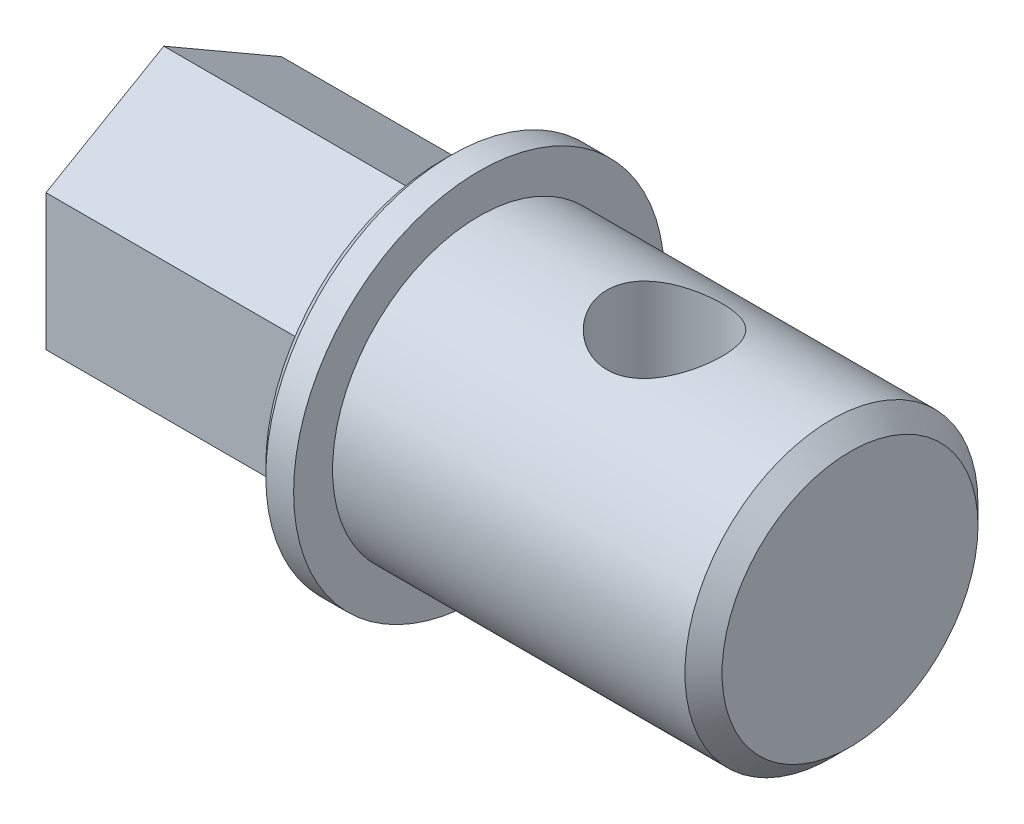
ISO-10303-21;
HEADER;
FILE_DESCRIPTION(('STEP AP214'),'2;1');
FILE_NAME('part.step','',(''),(''),'','','');
FILE_SCHEMA(('AUTOMOTIVE_DESIGN { 1 0 10303 214 1 1 1 1 }'));
ENDSEC;
DATA;
#1=APPLICATION_CONTEXT('core data for automotive mechanical design processes');
#2=APPLICATION_PROTOCOL_DEFINITION('international standard','automotive_design',2000,#1);
#3=PRODUCT_CONTEXT('',#1,'mechanical');
#4=PRODUCT('Part','Part','',(#3));
#5=PRODUCT_RELATED_PRODUCT_CATEGORY('part','',(#4));
#6=PRODUCT_DEFINITION_FORMATION('','',#4);
#7=PRODUCT_DEFINITION_CONTEXT('part definition',#1,'design');
#8=PRODUCT_DEFINITION('design','',#6,#7);
#9=PRODUCT_DEFINITION_SHAPE('','',#8);
#10=(LENGTH_UNIT() NAMED_UNIT(*) SI_UNIT(.MILLI.,.METRE.));
#11=(NAMED_UNIT(*) PLANE_ANGLE_UNIT() SI_UNIT($,.RADIAN.));
#12=(NAMED_UNIT(*) SI_UNIT($,.STERADIAN.) SOLID_ANGLE_UNIT());
#13=UNCERTAINTY_MEASURE_WITH_UNIT(LENGTH_MEASURE(1.E-05),#10,'distance_accuracy_value','');
#14=(GEOMETRIC_REPRESENTATION_CONTEXT(3) GLOBAL_UNCERTAINTY_ASSIGNED_CONTEXT((#13)) GLOBAL_UNIT_ASSIGNED_CONTEXT((#10,
#11,#12)) REPRESENTATION_CONTEXT('',''));
#15=CARTESIAN_POINT('',(0.,0.,0.));
#16=DIRECTION('',(0.,0.,1.));
#17=DIRECTION('',(1.,0.,0.));
#18=AXIS2_PLACEMENT_3D('',#15,#16,#17);
#19=CARTESIAN_POINT('',(20.,0.,0.));
#20=DIRECTION('',(-1.,0.,0.));
#21=DIRECTION('',(0.,0.,1.));
#22=AXIS2_PLACEMENT_3D('',#19,#20,#21);
#23=CYLINDRICAL_SURFACE('',#22,7.9);
#24=CARTESIAN_POINT('',(19.,0.,0.));
#25=DIRECTION('',(1.,0.,0.));
#26=DIRECTION('',(0.,0.,-1.));
#27=AXIS2_PLACEMENT_3D('',#24,#25,#26);
#28=CIRCLE('',#27,7.9);
#29=CARTESIAN_POINT('',(19.,0.,-7.9));
#30=VERTEX_POINT('',#29);
#31=EDGE_CURVE('E11',#30,#30,#28,.F.);
#32=ORIENTED_EDGE('',*,*,#31,.T.);
#33=EDGE_LOOP('',(#32));
#34=FACE_BOUND('',#33,.T.);
#35=CARTESIAN_POINT('',(10.,-7.26636084983398,3.1));
#36=CARTESIAN_POINT('',(10.1663346158653,-7.26636710949805,3.09999351847051));
#37=CARTESIAN_POINT('',(10.332955051347,-7.27215151188825,3.08653260810271));
#38=CARTESIAN_POINT('',(10.6614156667575,-7.29454929489087,3.03320818850061));
#39=CARTESIAN_POINT('',(10.8232421978606,-7.3111909710545,2.993275686265));
#40=CARTESIAN_POINT('',(11.136837463668,-7.35311644879813,2.88873826778125));
#41=CARTESIAN_POINT('',(11.288640815679,-7.37836842341094,2.82422411303483));
#42=CARTESIAN_POINT('',(11.5792296993829,-7.43462186683479,2.67262213711969));
#43=CARTESIAN_POINT('',(11.7180184258771,-7.46562191902808,2.58553987577835));
#44=CARTESIAN_POINT('',(11.9863577176001,-7.53178988522266,2.38614625265946));
#45=CARTESIAN_POINT('',(12.1151025114832,-7.56708854791225,2.27279336643924));
#46=CARTESIAN_POINT('',(12.3523408001219,-7.63679417086448,2.02627051594454));
#47=CARTESIAN_POINT('',(12.4608273547092,-7.67120082207378,1.8930937882975));
#48=CARTESIAN_POINT('',(12.6584190684678,-7.73680588764178,1.60452776876883));
#49=CARTESIAN_POINT('',(12.746638915474,-7.76783435643637,1.44849015051636));
#50=CARTESIAN_POINT('',(12.8952363077978,-7.82160938152175,1.12235484500192));
#51=CARTESIAN_POINT('',(12.9556247803773,-7.84435918747372,0.952262706866207));
#52=CARTESIAN_POINT('',(13.0439900088521,-7.8780889029301,0.611288894812916));
#53=CARTESIAN_POINT('',(13.0733510058438,-7.88956968563781,0.440816487760335));
#54=CARTESIAN_POINT('',(13.1032782997886,-7.90127416736964,0.097003592354353));
#55=CARTESIAN_POINT('',(13.1038549176573,-7.9015019012822,-0.0763358456964609));
#56=CARTESIAN_POINT('',(13.0769707233346,-7.89098374274002,-0.410982263764641));
#57=CARTESIAN_POINT('',(13.0510248395394,-7.88083077517019,-0.572432918358044));
#58=CARTESIAN_POINT('',(12.9744000798044,-7.85148454908576,-0.888475888709472));
#59=CARTESIAN_POINT('',(12.9237193950644,-7.83229062943026,-1.04306770199381));
#60=CARTESIAN_POINT('',(12.7984356728259,-7.78638595408502,-1.34376022091283));
#61=CARTESIAN_POINT('',(12.7234864867021,-7.75956716218171,-1.48969952838417));
#62=CARTESIAN_POINT('',(12.5521117557785,-7.70109054775387,-1.76730265121787));
#63=CARTESIAN_POINT('',(12.4556789739854,-7.66943109572801,-1.89896163381683));
#64=CARTESIAN_POINT('',(12.2369345031472,-7.60213011382686,-2.15313469104066));
#65=CARTESIAN_POINT('',(12.1133687799584,-7.56636337963099,-2.27453800786141));
#66=CARTESIAN_POINT('',(11.8474682063288,-7.4964461076441,-2.49534358123239));
#67=CARTESIAN_POINT('',(11.7051276940868,-7.4622960616265,-2.59473917672858));
#68=CARTESIAN_POINT('',(11.400934093372,-7.39864628524178,-2.77111583740955));
#69=CARTESIAN_POINT('',(11.2386662882743,-7.36929247480008,-2.84743866932457));
#70=CARTESIAN_POINT('',(10.9021231218695,-7.32026092803281,-2.97123993980027));
#71=CARTESIAN_POINT('',(10.7278552863409,-7.30057718904606,-3.01873627662334));
#72=CARTESIAN_POINT('',(10.3833103877494,-7.27455842500944,-3.08088870825382));
#73=CARTESIAN_POINT('',(10.2134097779068,-7.26750084415873,-3.09732569005301));
#74=CARTESIAN_POINT('',(9.87316855726062,-7.26547874677008,-3.10206978071329));
#75=CARTESIAN_POINT('',(9.70282808611748,-7.27051077392634,-3.09038492934167));
#76=CARTESIAN_POINT('',(9.37619241535563,-7.29136168311245,-3.0408365957478));
#77=CARTESIAN_POINT('',(9.2196352061247,-7.30658412661714,-3.00441907668649));
#78=CARTESIAN_POINT('',(8.91494687702002,-7.34537082896778,-2.9082973888063));
#79=CARTESIAN_POINT('',(8.7668175894863,-7.36893689384266,-2.84858817807036));
#80=CARTESIAN_POINT('',(8.47664372940254,-7.4229011344714,-2.70492734752464));
#81=CARTESIAN_POINT('',(8.33507352803402,-7.45353322003857,-2.62010812950565));
#82=CARTESIAN_POINT('',(8.06754885592117,-7.51781026296112,-2.42953287787291));
#83=CARTESIAN_POINT('',(7.94160058520701,-7.55145640747006,-2.32376857454229));
#84=CARTESIAN_POINT('',(7.69966093866379,-7.62083862099281,-2.08548659754756));
#85=CARTESIAN_POINT('',(7.58499967027525,-7.65655459372233,-1.95160756790945));
#86=CARTESIAN_POINT('',(7.37957891402032,-7.72380524707335,-1.66564707700384));
#87=CARTESIAN_POINT('',(7.28882009598321,-7.75533981050502,-1.51356510580068));
#88=CARTESIAN_POINT('',(7.1342062589481,-7.81073339597279,-1.19519200109596));
#89=CARTESIAN_POINT('',(7.07031544480831,-7.83460262013608,-1.02892012997483));
#90=CARTESIAN_POINT('',(6.97181459682315,-7.87196334688755,-0.686826238081698));
#91=CARTESIAN_POINT('',(6.93718933787567,-7.88546024523873,-0.511009233796531));
#92=CARTESIAN_POINT('',(6.89996032354475,-7.89999893201713,-0.166782109029406));
#93=CARTESIAN_POINT('',(6.8954732868068,-7.90177312742045,0.00139503627097473));
#94=CARTESIAN_POINT('',(6.91371471932851,-7.89462371314277,0.33601696631201));
#95=CARTESIAN_POINT('',(6.93643933294025,-7.88570161903031,0.502461993108063));
#96=CARTESIAN_POINT('',(7.00711865150312,-7.85851915942147,0.824011500662934));
#97=CARTESIAN_POINT('',(7.05433061774672,-7.84053412055966,0.979304350402065));
#98=CARTESIAN_POINT('',(7.17187728788584,-7.79713434870136,1.27974962339401));
#99=CARTESIAN_POINT('',(7.24221633143048,-7.77171822140757,1.42490013729913));
#100=CARTESIAN_POINT('',(7.40748802949084,-7.71458712095708,1.70789189369715));
#101=CARTESIAN_POINT('',(7.50335965698272,-7.68264574398631,1.84513809037886));
#102=CARTESIAN_POINT('',(7.71554859015978,-7.6163358678509,2.10215993043256));
#103=CARTESIAN_POINT('',(7.831873895833,-7.58196642216091,2.22192870424559));
#104=CARTESIAN_POINT('',(8.08979780802798,-7.5121619951126,2.44790370354027));
#105=CARTESIAN_POINT('',(8.23248343561413,-7.47678400107563,2.5528908434814));
#106=CARTESIAN_POINT('',(8.53459850477329,-7.41118964250036,2.7375005231295));
#107=CARTESIAN_POINT('',(8.69403018052225,-7.38097396810959,2.81711967263318));
#108=CARTESIAN_POINT('',(9.01088245776391,-7.33185112675661,2.94246477377473));
#109=CARTESIAN_POINT('',(9.16725518461086,-7.31218506218555,2.99054925616674));
#110=CARTESIAN_POINT('',(9.48626384723519,-7.28278017018195,3.06147434223789));
#111=CARTESIAN_POINT('',(9.64888076279454,-7.27301334718376,3.08438615105577));
#112=CARTESIAN_POINT('',(9.84343005691292,-7.26797919196603,3.09620318071312));
#113=CARTESIAN_POINT('',(9.87472061607179,-7.26737334317915,3.09762586595494));
#114=CARTESIAN_POINT('',(9.93733740063212,-7.26656356990444,3.09952491572971));
#115=CARTESIAN_POINT('',(9.96866362814162,-7.26635967055353,3.10000122107847));
#116=CARTESIAN_POINT('',(10.,-7.26636084983398,3.1));
#117=B_SPLINE_CURVE_WITH_KNOTS('',3,(#35,#36,#37,#38,#39,#40,#41,#42,#43,#44,#45,#46,#47,#48,
#49,#50,#51,#52,#53,#54,#55,#56,#57,#58,#59,#60,#61,#62,#63,#64,#65,#66,#67,#68,#69,#70,#71,#72,
#73,#74,#75,#76,#77,#78,#79,#80,#81,#82,#83,#84,#85,#86,#87,#88,#89,#90,#91,#92,#93,#94,#95,#96,
#97,#98,#99,#100,#101,#102,#103,#104,#105,#106,#107,#108,#109,#110,#111,#112,#113,#114,#115,
#116),.UNSPECIFIED.,.T.,.F.,(4,2,2,2,2,2,2,2,2,2,2,2,2,2,2,2,2,2,2,2,2,2,2,2,2,2,2,2,2,2,2,2,2,
2,2,2,2,2,2,2,4),(0.,0.498874424301249,0.999054205742628,1.49740482089948,1.99563278004856,
2.51870508656055,3.04195626233955,3.58494241162901,4.1277151895949,4.64509354386725,
5.16228638582811,5.65150295746495,6.14075530976998,6.63731841942563,7.13404905561471,
7.66230622600664,8.19072306554442,8.7330368891427,9.27501364673122,9.78484159993364,
10.2945238154401,10.7767158069103,11.2590122357218,11.7604380692871,12.2620622762048,
12.7990899242406,13.336132620046,13.8724575516268,14.4085032936735,14.9107131357066,
15.4128518275076,15.9005807086209,16.3884011612398,16.8975012425558,17.4068008914588,
17.94618562104,18.4856424043234,18.977830198215,19.4686221428478,19.5626009988923,
19.6565857319511),.UNSPECIFIED.);
#118=CARTESIAN_POINT('',(10.,-7.26636084983398,3.1));
#119=VERTEX_POINT('',#118);
#120=EDGE_CURVE('E142',#119,#119,#117,.T.);
#121=ORIENTED_EDGE('',*,*,#120,.T.);
#122=EDGE_LOOP('',(#121));
#123=FACE_BOUND('',#122,.T.);
#124=CARTESIAN_POINT('',(10.,7.26636084983398,3.1));
#125=CARTESIAN_POINT('',(9.83366538413467,7.26636710949805,3.09999351847051));
#126=CARTESIAN_POINT('',(9.66704494865304,7.27215151188824,3.08653260810271));
#127=CARTESIAN_POINT('',(9.33858433324254,7.29454929489087,3.03320818850061));
#128=CARTESIAN_POINT('',(9.17675780213939,7.3111909710545,2.993275686265));
#129=CARTESIAN_POINT('',(8.86316253633202,7.35311644879813,2.88873826778125));
#130=CARTESIAN_POINT('',(8.71135918432105,7.37836842341094,2.82422411303483));
#131=CARTESIAN_POINT('',(8.42077030061706,7.43462186683479,2.67262213711969));
#132=CARTESIAN_POINT('',(8.28198157412286,7.46562191902808,2.58553987577835));
#133=CARTESIAN_POINT('',(8.01364228239994,7.53178988522266,2.38614625265946));
#134=CARTESIAN_POINT('',(7.88489748851683,7.56708854791225,2.27279336643924));
#135=CARTESIAN_POINT('',(7.64765919987812,7.63679417086448,2.02627051594454));
#136=CARTESIAN_POINT('',(7.5391726452908,7.67120082207378,1.89309378829751));
#137=CARTESIAN_POINT('',(7.34158093153223,7.73680588764178,1.60452776876883));
#138=CARTESIAN_POINT('',(7.25336108452604,7.76783435643637,1.44849015051636));
#139=CARTESIAN_POINT('',(7.10476369220221,7.82160938152175,1.12235484500192));
#140=CARTESIAN_POINT('',(7.04437521962266,7.84435918747372,0.952262706866207));
#141=CARTESIAN_POINT('',(6.95600999114795,7.8780889029301,0.611288894812916));
#142=CARTESIAN_POINT('',(6.92664899415624,7.88956968563781,0.440816487760335));
#143=CARTESIAN_POINT('',(6.89672170021145,7.90127416736964,0.0970035923543531));
#144=CARTESIAN_POINT('',(6.89614508234274,7.9015019012822,-0.0763358456964607));
#145=CARTESIAN_POINT('',(6.92302927666537,7.89098374274002,-0.410982263764641));
#146=CARTESIAN_POINT('',(6.94897516046064,7.88083077517019,-0.572432918358044));
#147=CARTESIAN_POINT('',(7.02559992019559,7.85148454908576,-0.888475888709472));
#148=CARTESIAN_POINT('',(7.07628060493559,7.83229062943026,-1.04306770199381));
#149=CARTESIAN_POINT('',(7.20156432717407,7.78638595408502,-1.34376022091283));
#150=CARTESIAN_POINT('',(7.2765135132979,7.75956716218171,-1.48969952838417));
#151=CARTESIAN_POINT('',(7.44788824422155,7.70109054775387,-1.76730265121787));
#152=CARTESIAN_POINT('',(7.54432102601463,7.66943109572801,-1.89896163381684));
#153=CARTESIAN_POINT('',(7.76306549685278,7.60213011382686,-2.15313469104066));
#154=CARTESIAN_POINT('',(7.8866312200416,7.56636337963099,-2.27453800786141));
#155=CARTESIAN_POINT('',(8.1525317936712,7.49644610764409,-2.49534358123239));
#156=CARTESIAN_POINT('',(8.29487230591324,7.4622960616265,-2.59473917672858));
#157=CARTESIAN_POINT('',(8.59906590662803,7.39864628524178,-2.77111583740955));
#158=CARTESIAN_POINT('',(8.76133371172566,7.36929247480008,-2.84743866932457));
#159=CARTESIAN_POINT('',(9.09787687813051,7.32026092803281,-2.97123993980027));
#160=CARTESIAN_POINT('',(9.2721447136591,7.30057718904606,-3.01873627662334));
#161=CARTESIAN_POINT('',(9.61668961225058,7.27455842500945,-3.08088870825382));
#162=CARTESIAN_POINT('',(9.78659022209319,7.26750084415873,-3.09732569005301));
#163=CARTESIAN_POINT('',(10.1268314427394,7.26547874677008,-3.10206978071329));
#164=CARTESIAN_POINT('',(10.2971719138825,7.27051077392634,-3.09038492934168));
#165=CARTESIAN_POINT('',(10.6238075846444,7.29136168311245,-3.0408365957478));
#166=CARTESIAN_POINT('',(10.7803647938753,7.30658412661714,-3.00441907668649));
#167=CARTESIAN_POINT('',(11.08505312298,7.34537082896778,-2.9082973888063));
#168=CARTESIAN_POINT('',(11.2331824105137,7.36893689384266,-2.84858817807036));
#169=CARTESIAN_POINT('',(11.5233562705975,7.4229011344714,-2.70492734752464));
#170=CARTESIAN_POINT('',(11.664926471966,7.45353322003857,-2.62010812950565));
#171=CARTESIAN_POINT('',(11.9324511440788,7.51781026296112,-2.42953287787291));
#172=CARTESIAN_POINT('',(12.058399414793,7.55145640747006,-2.32376857454229));
#173=CARTESIAN_POINT('',(12.3003390613362,7.62083862099281,-2.08548659754756));
#174=CARTESIAN_POINT('',(12.4150003297248,7.65655459372233,-1.95160756790945));
#175=CARTESIAN_POINT('',(12.6204210859797,7.72380524707335,-1.66564707700384));
#176=CARTESIAN_POINT('',(12.7111799040168,7.75533981050502,-1.51356510580068));
#177=CARTESIAN_POINT('',(12.8657937410519,7.81073339597279,-1.19519200109596));
#178=CARTESIAN_POINT('',(12.9296845551917,7.83460262013608,-1.02892012997483));
#179=CARTESIAN_POINT('',(13.0281854031769,7.87196334688755,-0.686826238081699));
#180=CARTESIAN_POINT('',(13.0628106621243,7.88546024523873,-0.511009233796531));
#181=CARTESIAN_POINT('',(13.1000396764553,7.89999893201713,-0.166782109029406));
#182=CARTESIAN_POINT('',(13.1045267131932,7.90177312742045,0.00139503627097489));
#183=CARTESIAN_POINT('',(13.0862852806715,7.89462371314277,0.33601696631201));
#184=CARTESIAN_POINT('',(13.0635606670598,7.88570161903031,0.502461993108063));
#185=CARTESIAN_POINT('',(12.9928813484969,7.85851915942147,0.824011500662933));
#186=CARTESIAN_POINT('',(12.9456693822533,7.84053412055966,0.979304350402064));
#187=CARTESIAN_POINT('',(12.8281227121142,7.79713434870136,1.27974962339401));
#188=CARTESIAN_POINT('',(12.7577836685695,7.77171822140757,1.42490013729913));
#189=CARTESIAN_POINT('',(12.5925119705092,7.71458712095708,1.70789189369715));
#190=CARTESIAN_POINT('',(12.4966403430173,7.68264574398631,1.84513809037886));
#191=CARTESIAN_POINT('',(12.2844514098402,7.6163358678509,2.10215993043256));
#192=CARTESIAN_POINT('',(12.168126104167,7.58196642216091,2.22192870424559));
#193=CARTESIAN_POINT('',(11.910202191972,7.5121619951126,2.44790370354027));
#194=CARTESIAN_POINT('',(11.7675165643859,7.47678400107563,2.5528908434814));
#195=CARTESIAN_POINT('',(11.4654014952267,7.41118964250037,2.7375005231295));
#196=CARTESIAN_POINT('',(11.3059698194777,7.38097396810959,2.81711967263318));
#197=CARTESIAN_POINT('',(10.9891175422361,7.33185112675661,2.94246477377473));
#198=CARTESIAN_POINT('',(10.8327448153891,7.31218506218555,2.99054925616674));
#199=CARTESIAN_POINT('',(10.5137361527648,7.28278017018195,3.06147434223789));
#200=CARTESIAN_POINT('',(10.3511192372055,7.27301334718375,3.08438615105577));
#201=CARTESIAN_POINT('',(10.1565699430871,7.26797919196603,3.09620318071312));
#202=CARTESIAN_POINT('',(10.1252793839282,7.26737334317915,3.09762586595494));
#203=CARTESIAN_POINT('',(10.0626625993679,7.26656356990444,3.09952491572971));
#204=CARTESIAN_POINT('',(10.0313363718584,7.26635967055353,3.10000122107847));
#205=CARTESIAN_POINT('',(10.,7.26636084983398,3.1));
#206=B_SPLINE_CURVE_WITH_KNOTS('',3,(#124,#125,#126,#127,#128,#129,#130,#131,#132,#133,#134,
#135,#136,#137,#138,#139,#140,#141,#142,#143,#144,#145,#146,#147,#148,#149,#150,#151,#152,#153,
#154,#155,#156,#157,#158,#159,#160,#161,#162,#163,#164,#165,#166,#167,#168,#169,#170,#171,#172,
#173,#174,#175,#176,#177,#178,#179,#180,#181,#182,#183,#184,#185,#186,#187,#188,#189,#190,#191,
#192,#193,#194,#195,#196,#197,#198,#199,#200,#201,#202,#203,#204,#205),.UNSPECIFIED.,.T.,.F.,(4,
2,2,2,2,2,2,2,2,2,2,2,2,2,2,2,2,2,2,2,2,2,2,2,2,2,2,2,2,2,2,2,2,2,2,2,2,2,2,2,4),(0.,
0.498874424301249,0.999054205742628,1.49740482089948,1.99563278004856,2.51870508656055,
3.04195626233955,3.58494241162901,4.1277151895949,4.64509354386725,5.16228638582811,
5.65150295746495,6.14075530976998,6.63731841942563,7.13404905561471,7.66230622600664,
8.19072306554442,8.7330368891427,9.27501364673121,9.78484159993364,10.2945238154401,
10.7767158069103,11.2590122357218,11.7604380692871,12.2620622762048,12.7990899242406,
13.336132620046,13.8724575516268,14.4085032936735,14.9107131357066,15.4128518275076,
15.9005807086209,16.3884011612398,16.8975012425558,17.4068008914588,17.94618562104,
18.4856424043234,18.977830198215,19.4686221428478,19.5626009988923,19.6565857319511),.UNSPECIFIED.);
#207=CARTESIAN_POINT('',(10.,7.26636084983398,3.1));
#208=VERTEX_POINT('',#207);
#209=EDGE_CURVE('E133',#208,#208,#206,.T.);
#210=ORIENTED_EDGE('',*,*,#209,.T.);
#211=EDGE_LOOP('',(#210));
#212=FACE_BOUND('',#211,.T.);
#213=CARTESIAN_POINT('',(0.,0.,0.));
#214=DIRECTION('',(1.,0.,0.));
#215=DIRECTION('',(0.,0.,-1.));
#216=AXIS2_PLACEMENT_3D('',#213,#214,#215);
#217=CIRCLE('',#216,7.9);
#218=CARTESIAN_POINT('',(0.,0.,-7.9));
#219=VERTEX_POINT('',#218);
#220=EDGE_CURVE('E123',#219,#219,#217,.T.);
#221=ORIENTED_EDGE('',*,*,#220,.T.);
#222=EDGE_LOOP('',(#221));
#223=FACE_BOUND('',#222,.T.);
#224=ADVANCED_FACE('F40',(#34,#123,#212,#223),#23,.T.);
#225=CARTESIAN_POINT('',(20.,0.,0.));
#226=DIRECTION('',(1.,0.,0.));
#227=DIRECTION('',(0.,0.,-1.));
#228=AXIS2_PLACEMENT_3D('',#225,#226,#227);
#229=PLANE('',#228);
#230=CARTESIAN_POINT('',(20.,0.,0.));
#231=DIRECTION('',(1.,0.,0.));
#232=DIRECTION('',(0.,0.,-1.));
#233=AXIS2_PLACEMENT_3D('',#230,#231,#232);
#234=CIRCLE('',#233,6.89999999999999);
#235=CARTESIAN_POINT('',(20.,0.,-6.89999999999999));
#236=VERTEX_POINT('',#235);
#237=EDGE_CURVE('E50',#236,#236,#234,.T.);
#238=ORIENTED_EDGE('',*,*,#237,.T.);
#239=EDGE_LOOP('',(#238));
#240=FACE_BOUND('',#239,.T.);
#241=ADVANCED_FACE('F193',(#240),#229,.T.);
#242=CARTESIAN_POINT('',(-2.,0.,0.));
#243=DIRECTION('',(1.,0.,0.));
#244=DIRECTION('',(0.,0.,-1.));
#245=AXIS2_PLACEMENT_3D('',#242,#243,#244);
#246=CYLINDRICAL_SURFACE('',#245,10.);
#247=CARTESIAN_POINT('',(-1.49999999999999,0.,0.));
#248=DIRECTION('',(-1.,0.,0.));
#249=DIRECTION('',(0.,0.,1.));
#250=AXIS2_PLACEMENT_3D('',#247,#248,#249);
#251=CIRCLE('',#250,10.);
#252=CARTESIAN_POINT('',(-1.49999999999999,0.,10.));
#253=VERTEX_POINT('',#252);
#254=EDGE_CURVE('E206',#253,#253,#251,.F.);
#255=ORIENTED_EDGE('',*,*,#254,.T.);
#256=EDGE_LOOP('',(#255));
#257=FACE_BOUND('',#256,.T.);
#258=CARTESIAN_POINT('',(0.,0.,0.));
#259=DIRECTION('',(-1.,0.,0.));
#260=DIRECTION('',(0.,0.,1.));
#261=AXIS2_PLACEMENT_3D('',#258,#259,#260);
#262=CIRCLE('',#261,10.);
#263=CARTESIAN_POINT('',(0.,0.,10.));
#264=VERTEX_POINT('',#263);
#265=EDGE_CURVE('E118',#264,#264,#262,.T.);
#266=ORIENTED_EDGE('',*,*,#265,.T.);
#267=EDGE_LOOP('',(#266));
#268=FACE_BOUND('',#267,.T.);
#269=ADVANCED_FACE('F187',(#257,#268),#246,.T.);
#270=CARTESIAN_POINT('',(-2.,0.,0.));
#271=DIRECTION('',(-1.,0.,0.));
#272=DIRECTION('',(0.,0.,1.));
#273=AXIS2_PLACEMENT_3D('',#270,#271,#272);
#274=PLANE('',#273);
#275=CARTESIAN_POINT('',(-2.,0.,0.));
#276=DIRECTION('',(-1.,0.,0.));
#277=DIRECTION('',(0.,0.,1.));
#278=AXIS2_PLACEMENT_3D('',#275,#276,#277);
#279=CIRCLE('',#278,9.5);
#280=CARTESIAN_POINT('',(-2.,0.,9.5));
#281=VERTEX_POINT('',#280);
#282=EDGE_CURVE('E132',#281,#281,#279,.T.);
#283=ORIENTED_EDGE('',*,*,#282,.T.);
#284=EDGE_LOOP('',(#283));
#285=FACE_BOUND('',#284,.T.);
#286=DIRECTION('',(0.,1.,0.));
#287=VECTOR('',#286,1.);
#288=CARTESIAN_POINT('',(-2.,-3.6661742093541,6.35000000000002));
#289=LINE('',#288,#287);
#290=CARTESIAN_POINT('',(-2.,-3.6661742093541,6.35000000000002));
#291=VERTEX_POINT('',#290);
#292=CARTESIAN_POINT('',(-2.,3.66617420935415,6.34999999999999));
#293=VERTEX_POINT('',#292);
#294=EDGE_CURVE('E57',#291,#293,#289,.T.);
#295=ORIENTED_EDGE('',*,*,#294,.F.);
#296=DIRECTION('',(0.,0.500000000000004,0.866025403784436));
#297=VECTOR('',#296,1.);
#298=CARTESIAN_POINT('',(-2.,-7.33234841870825,0.));
#299=LINE('',#298,#297);
#300=CARTESIAN_POINT('',(-2.,-7.33234841870825,0.));
#301=VERTEX_POINT('',#300);
#302=EDGE_CURVE('E61',#301,#291,#299,.T.);
#303=ORIENTED_EDGE('',*,*,#302,.F.);
#304=DIRECTION('',(0.,-0.499999999999996,0.866025403784441));
#305=VECTOR('',#304,1.);
#306=CARTESIAN_POINT('',(-2.,-3.66617420935416,-6.34999999999998));
#307=LINE('',#306,#305);
#308=CARTESIAN_POINT('',(-2.,-3.66617420935416,-6.34999999999998));
#309=VERTEX_POINT('',#308);
#310=EDGE_CURVE('E269',#309,#301,#307,.T.);
#311=ORIENTED_EDGE('',*,*,#310,.F.);
#312=DIRECTION('',(0.,-1.,0.));
#313=VECTOR('',#312,1.);
#314=CARTESIAN_POINT('',(-2.,3.66617420935409,-6.35000000000002));
#315=LINE('',#314,#313);
#316=CARTESIAN_POINT('',(-2.,3.66617420935409,-6.35000000000002));
#317=VERTEX_POINT('',#316);
#318=EDGE_CURVE('E265',#317,#309,#315,.T.);
#319=ORIENTED_EDGE('',*,*,#318,.F.);
#320=DIRECTION('',(0.,-0.500000000000004,-0.866025403784436));
#321=VECTOR('',#320,1.);
#322=CARTESIAN_POINT('',(-2.,7.33234841870825,0.));
#323=LINE('',#322,#321);
#324=CARTESIAN_POINT('',(-2.,7.33234841870825,0.));
#325=VERTEX_POINT('',#324);
#326=EDGE_CURVE('E261',#325,#317,#323,.T.);
#327=ORIENTED_EDGE('',*,*,#326,.F.);
#328=DIRECTION('',(0.,0.499999999999997,-0.866025403784441));
#329=VECTOR('',#328,1.);
#330=CARTESIAN_POINT('',(-2.,3.66617420935415,6.34999999999999));
#331=LINE('',#330,#329);
#332=EDGE_CURVE('E258',#293,#325,#331,.T.);
#333=ORIENTED_EDGE('',*,*,#332,.F.);
#334=EDGE_LOOP('',(#295,#303,#311,#319,#327,#333));
#335=FACE_BOUND('',#334,.T.);
#336=ADVANCED_FACE('F184',(#285,#335),#274,.T.);
#337=CARTESIAN_POINT('',(0.,0.,0.));
#338=DIRECTION('',(-1.,0.,0.));
#339=DIRECTION('',(0.,0.,1.));
#340=AXIS2_PLACEMENT_3D('',#337,#338,#339);
#341=PLANE('',#340);
#342=ORIENTED_EDGE('',*,*,#220,.F.);
#343=EDGE_LOOP('',(#342));
#344=FACE_BOUND('',#343,.T.);
#345=ORIENTED_EDGE('',*,*,#265,.F.);
#346=EDGE_LOOP('',(#345));
#347=FACE_BOUND('',#346,.T.);
#348=ADVANCED_FACE('F183',(#344,#347),#341,.F.);
#349=CARTESIAN_POINT('',(-17.,-3.6661742093541,6.35000000000002));
#350=DIRECTION('',(0.,0.,-1.));
#351=DIRECTION('',(0.,1.,0.));
#352=AXIS2_PLACEMENT_3D('',#349,#350,#351);
#353=PLANE('',#352);
#354=ORIENTED_EDGE('',*,*,#294,.T.);
#355=DIRECTION('',(1.,0.,0.));
#356=VECTOR('',#355,1.);
#357=CARTESIAN_POINT('',(-17.,3.66617420935415,6.34999999999999));
#358=LINE('',#357,#356);
#359=CARTESIAN_POINT('',(-17.,3.66617420935415,6.34999999999999));
#360=VERTEX_POINT('',#359);
#361=EDGE_CURVE('E98',#360,#293,#358,.T.);
#362=ORIENTED_EDGE('',*,*,#361,.F.);
#363=DIRECTION('',(0.,1.,0.));
#364=VECTOR('',#363,1.);
#365=CARTESIAN_POINT('',(-17.,-3.6661742093541,6.35000000000002));
#366=LINE('',#365,#364);
#367=CARTESIAN_POINT('',(-17.,-3.6661742093541,6.35000000000002));
#368=VERTEX_POINT('',#367);
#369=EDGE_CURVE('E105',#368,#360,#366,.T.);
#370=ORIENTED_EDGE('',*,*,#369,.F.);
#371=DIRECTION('',(1.,0.,0.));
#372=VECTOR('',#371,1.);
#373=CARTESIAN_POINT('',(-17.,-3.6661742093541,6.35000000000002));
#374=LINE('',#373,#372);
#375=EDGE_CURVE('E255',#368,#291,#374,.T.);
#376=ORIENTED_EDGE('',*,*,#375,.T.);
#377=EDGE_LOOP('',(#354,#362,#370,#376));
#378=FACE_BOUND('',#377,.T.);
#379=ADVANCED_FACE('F116',(#378),#353,.F.);
#380=CARTESIAN_POINT('',(-17.,3.66617420935415,6.34999999999999));
#381=DIRECTION('',(0.,-0.866025403784441,-0.499999999999996));
#382=DIRECTION('',(0.,0.499999999999997,-0.866025403784441));
#383=AXIS2_PLACEMENT_3D('',#380,#381,#382);
#384=PLANE('',#383);
#385=ORIENTED_EDGE('',*,*,#332,.T.);
#386=DIRECTION('',(1.,0.,0.));
#387=VECTOR('',#386,1.);
#388=CARTESIAN_POINT('',(-17.,7.33234841870825,0.));
#389=LINE('',#388,#387);
#390=CARTESIAN_POINT('',(-17.,7.33234841870825,0.));
#391=VERTEX_POINT('',#390);
#392=EDGE_CURVE('E100',#391,#325,#389,.T.);
#393=ORIENTED_EDGE('',*,*,#392,.F.);
#394=DIRECTION('',(0.,0.499999999999997,-0.866025403784441));
#395=VECTOR('',#394,1.);
#396=CARTESIAN_POINT('',(-17.,3.66617420935415,6.34999999999999));
#397=LINE('',#396,#395);
#398=EDGE_CURVE('E93',#360,#391,#397,.T.);
#399=ORIENTED_EDGE('',*,*,#398,.F.);
#400=ORIENTED_EDGE('',*,*,#361,.T.);
#401=EDGE_LOOP('',(#385,#393,#399,#400));
#402=FACE_BOUND('',#401,.T.);
#403=ADVANCED_FACE('F96',(#402),#384,.F.);
#404=CARTESIAN_POINT('',(-17.,7.33234841870825,0.));
#405=DIRECTION('',(0.,-0.866025403784436,0.500000000000004));
#406=DIRECTION('',(0.,-0.500000000000005,-0.866025403784436));
#407=AXIS2_PLACEMENT_3D('',#404,#405,#406);
#408=PLANE('',#407);
#409=ORIENTED_EDGE('',*,*,#326,.T.);
#410=DIRECTION('',(1.,0.,0.));
#411=VECTOR('',#410,1.);
#412=CARTESIAN_POINT('',(-17.,3.66617420935409,-6.35000000000002));
#413=LINE('',#412,#411);
#414=CARTESIAN_POINT('',(-17.,3.66617420935409,-6.35000000000002));
#415=VERTEX_POINT('',#414);
#416=EDGE_CURVE('E125',#415,#317,#413,.T.);
#417=ORIENTED_EDGE('',*,*,#416,.F.);
#418=DIRECTION('',(0.,-0.500000000000004,-0.866025403784436));
#419=VECTOR('',#418,1.);
#420=CARTESIAN_POINT('',(-17.,7.33234841870825,0.));
#421=LINE('',#420,#419);
#422=EDGE_CURVE('E104',#391,#415,#421,.T.);
#423=ORIENTED_EDGE('',*,*,#422,.F.);
#424=ORIENTED_EDGE('',*,*,#392,.T.);
#425=EDGE_LOOP('',(#409,#417,#423,#424));
#426=FACE_BOUND('',#425,.T.);
#427=ADVANCED_FACE('F174',(#426),#408,.F.);
#428=CARTESIAN_POINT('',(-17.,3.66617420935409,-6.35000000000002));
#429=DIRECTION('',(0.,0.,1.));
#430=DIRECTION('',(0.,-1.,0.));
#431=AXIS2_PLACEMENT_3D('',#428,#429,#430);
#432=PLANE('',#431);
#433=ORIENTED_EDGE('',*,*,#318,.T.);
#434=DIRECTION('',(1.,0.,0.));
#435=VECTOR('',#434,1.);
#436=CARTESIAN_POINT('',(-17.,-3.66617420935416,-6.34999999999998));
#437=LINE('',#436,#435);
#438=CARTESIAN_POINT('',(-17.,-3.66617420935416,-6.34999999999998));
#439=VERTEX_POINT('',#438);
#440=EDGE_CURVE('E280',#439,#309,#437,.T.);
#441=ORIENTED_EDGE('',*,*,#440,.F.);
#442=DIRECTION('',(0.,-1.,0.));
#443=VECTOR('',#442,1.);
#444=CARTESIAN_POINT('',(-17.,3.66617420935409,-6.35000000000002));
#445=LINE('',#444,#443);
#446=EDGE_CURVE('E247',#415,#439,#445,.T.);
#447=ORIENTED_EDGE('',*,*,#446,.F.);
#448=ORIENTED_EDGE('',*,*,#416,.T.);
#449=EDGE_LOOP('',(#433,#441,#447,#448));
#450=FACE_BOUND('',#449,.T.);
#451=ADVANCED_FACE('F170',(#450),#432,.F.);
#452=CARTESIAN_POINT('',(-17.,-3.66617420935416,-6.34999999999998));
#453=DIRECTION('',(0.,0.866025403784441,0.499999999999996));
#454=DIRECTION('',(0.,-0.499999999999996,0.866025403784441));
#455=AXIS2_PLACEMENT_3D('',#452,#453,#454);
#456=PLANE('',#455);
#457=ORIENTED_EDGE('',*,*,#310,.T.);
#458=DIRECTION('',(1.,0.,0.));
#459=VECTOR('',#458,1.);
#460=CARTESIAN_POINT('',(-17.,-7.33234841870825,0.));
#461=LINE('',#460,#459);
#462=CARTESIAN_POINT('',(-17.,-7.33234841870825,0.));
#463=VERTEX_POINT('',#462);
#464=EDGE_CURVE('E276',#463,#301,#461,.T.);
#465=ORIENTED_EDGE('',*,*,#464,.F.);
#466=DIRECTION('',(0.,-0.499999999999996,0.866025403784441));
#467=VECTOR('',#466,1.);
#468=CARTESIAN_POINT('',(-17.,-3.66617420935416,-6.34999999999998));
#469=LINE('',#468,#467);
#470=EDGE_CURVE('E250',#439,#463,#469,.T.);
#471=ORIENTED_EDGE('',*,*,#470,.F.);
#472=ORIENTED_EDGE('',*,*,#440,.T.);
#473=EDGE_LOOP('',(#457,#465,#471,#472));
#474=FACE_BOUND('',#473,.T.);
#475=ADVANCED_FACE('F166',(#474),#456,.F.);
#476=CARTESIAN_POINT('',(-17.,-7.33234841870825,0.));
#477=DIRECTION('',(0.,0.866025403784436,-0.500000000000004));
#478=DIRECTION('',(0.,0.500000000000004,0.866025403784437));
#479=AXIS2_PLACEMENT_3D('',#476,#477,#478);
#480=PLANE('',#479);
#481=ORIENTED_EDGE('',*,*,#302,.T.);
#482=ORIENTED_EDGE('',*,*,#375,.F.);
#483=DIRECTION('',(0.,0.500000000000004,0.866025403784436));
#484=VECTOR('',#483,1.);
#485=CARTESIAN_POINT('',(-17.,-7.33234841870825,0.));
#486=LINE('',#485,#484);
#487=EDGE_CURVE('E110',#463,#368,#486,.T.);
#488=ORIENTED_EDGE('',*,*,#487,.F.);
#489=ORIENTED_EDGE('',*,*,#464,.T.);
#490=EDGE_LOOP('',(#481,#482,#488,#489));
#491=FACE_BOUND('',#490,.T.);
#492=ADVANCED_FACE('F162',(#491),#480,.F.);
#493=CARTESIAN_POINT('',(-17.,0.,0.));
#494=DIRECTION('',(-1.,0.,0.));
#495=DIRECTION('',(0.,0.,1.));
#496=AXIS2_PLACEMENT_3D('',#493,#494,#495);
#497=PLANE('',#496);
#498=CARTESIAN_POINT('',(-17.,0.,0.));
#499=DIRECTION('',(-1.,0.,0.));
#500=DIRECTION('',(0.,0.,1.));
#501=AXIS2_PLACEMENT_3D('',#498,#499,#500);
#502=CIRCLE('',#501,2.6);
#503=CARTESIAN_POINT('',(-17.,0.,2.6));
#504=VERTEX_POINT('',#503);
#505=EDGE_CURVE('E239',#504,#504,#502,.T.);
#506=ORIENTED_EDGE('',*,*,#505,.F.);
#507=EDGE_LOOP('',(#506));
#508=FACE_BOUND('',#507,.T.);
#509=ORIENTED_EDGE('',*,*,#369,.T.);
#510=ORIENTED_EDGE('',*,*,#398,.T.);
#511=ORIENTED_EDGE('',*,*,#422,.T.);
#512=ORIENTED_EDGE('',*,*,#446,.T.);
#513=ORIENTED_EDGE('',*,*,#470,.T.);
#514=ORIENTED_EDGE('',*,*,#487,.T.);
#515=EDGE_LOOP('',(#509,#510,#511,#512,#513,#514));
#516=FACE_BOUND('',#515,.T.);
#517=ADVANCED_FACE('F108',(#508,#516),#497,.T.);
#518=CARTESIAN_POINT('',(10.,-10.,0.));
#519=DIRECTION('',(0.,1.,0.));
#520=DIRECTION('',(0.,0.,1.));
#521=AXIS2_PLACEMENT_3D('',#518,#519,#520);
#522=CYLINDRICAL_SURFACE('',#521,3.1);
#523=ORIENTED_EDGE('',*,*,#209,.F.);
#524=EDGE_LOOP('',(#523));
#525=FACE_BOUND('',#524,.T.);
#526=ORIENTED_EDGE('',*,*,#120,.F.);
#527=EDGE_LOOP('',(#526));
#528=FACE_BOUND('',#527,.T.);
#529=ADVANCED_FACE('F150',(#525,#528),#522,.F.);
#530=CARTESIAN_POINT('',(-2.,0.,0.));
#531=DIRECTION('',(1.,0.,0.));
#532=DIRECTION('',(0.,0.,-1.));
#533=AXIS2_PLACEMENT_3D('',#530,#531,#532);
#534=CONICAL_SURFACE('',#533,9.5,0.785398163397441);
#535=ORIENTED_EDGE('',*,*,#254,.F.);
#536=EDGE_LOOP('',(#535));
#537=FACE_BOUND('',#536,.T.);
#538=ORIENTED_EDGE('',*,*,#282,.F.);
#539=EDGE_LOOP('',(#538));
#540=FACE_BOUND('',#539,.T.);
#541=ADVANCED_FACE('F155',(#537,#540),#534,.T.);
#542=CARTESIAN_POINT('',(-2.,0.,0.));
#543=DIRECTION('',(-1.,0.,0.));
#544=DIRECTION('',(0.,0.,1.));
#545=AXIS2_PLACEMENT_3D('',#542,#543,#544);
#546=CYLINDRICAL_SURFACE('',#545,2.6);
#547=CARTESIAN_POINT('',(-2.,0.,0.));
#548=DIRECTION('',(-1.,0.,0.));
#549=DIRECTION('',(0.,0.,1.));
#550=AXIS2_PLACEMENT_3D('',#547,#548,#549);
#551=CIRCLE('',#550,2.6);
#552=CARTESIAN_POINT('',(-2.,0.,2.6));
#553=VERTEX_POINT('',#552);
#554=EDGE_CURVE('E143',#553,#553,#551,.T.);
#555=ORIENTED_EDGE('',*,*,#554,.F.);
#556=EDGE_LOOP('',(#555));
#557=FACE_BOUND('',#556,.T.);
#558=ORIENTED_EDGE('',*,*,#505,.T.);
#559=EDGE_LOOP('',(#558));
#560=FACE_BOUND('',#559,.T.);
#561=ADVANCED_FACE('F157',(#557,#560),#546,.F.);
#562=CARTESIAN_POINT('',(-2.,0.,0.));
#563=DIRECTION('',(-1.,0.,0.));
#564=DIRECTION('',(0.,0.,1.));
#565=AXIS2_PLACEMENT_3D('',#562,#563,#564);
#566=PLANE('',#565);
#567=ORIENTED_EDGE('',*,*,#554,.T.);
#568=EDGE_LOOP('',(#567));
#569=FACE_BOUND('',#568,.T.);
#570=ADVANCED_FACE('F219',(#569),#566,.T.);
#571=CARTESIAN_POINT('',(20.,0.,0.));
#572=DIRECTION('',(-1.,0.,0.));
#573=DIRECTION('',(0.,0.,1.));
#574=AXIS2_PLACEMENT_3D('',#571,#572,#573);
#575=CONICAL_SURFACE('',#574,6.89999999999999,0.785398163397447);
#576=ORIENTED_EDGE('',*,*,#31,.F.);
#577=EDGE_LOOP('',(#576));
#578=FACE_BOUND('',#577,.T.);
#579=ORIENTED_EDGE('',*,*,#237,.F.);
#580=EDGE_LOOP('',(#579));
#581=FACE_BOUND('',#580,.T.);
#582=ADVANCED_FACE('F43',(#578,#581),#575,.T.);
#583=CLOSED_SHELL('',(#224,#241,#269,#336,#348,#379,#403,#427,#451,#475,#492,#517,#529,#541,
#561,#570,#582));
#584=MANIFOLD_SOLID_BREP('B2',#583);
#585=ADVANCED_BREP_SHAPE_REPRESENTATION('',(#18,#584),#14);
#586=SHAPE_DEFINITION_REPRESENTATION(#9,#585);
ENDSEC;
END-ISO-10303-21;
